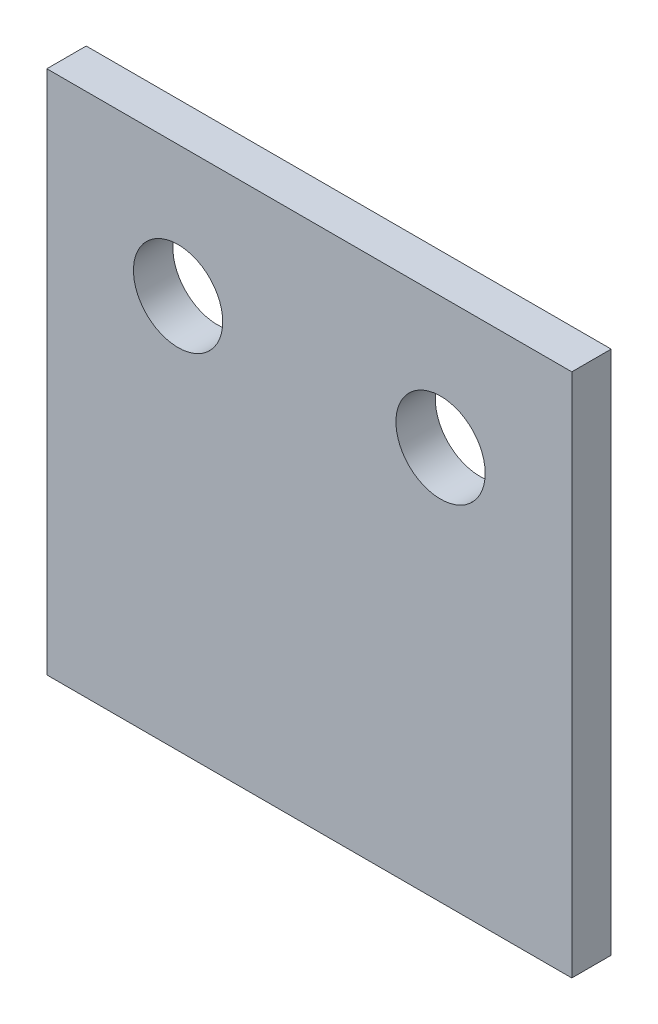
ISO-10303-21;
HEADER;
FILE_DESCRIPTION(('STEP AP214'),'2;1');
FILE_NAME('part.step','',(''),(''),'','','');
FILE_SCHEMA(('AUTOMOTIVE_DESIGN { 1 0 10303 214 1 1 1 1 }'));
ENDSEC;
DATA;
#1=APPLICATION_CONTEXT('core data for automotive mechanical design processes');
#2=APPLICATION_PROTOCOL_DEFINITION('international standard','automotive_design',2000,#1);
#3=PRODUCT_CONTEXT('',#1,'mechanical');
#4=PRODUCT('Part','Part','',(#3));
#5=PRODUCT_RELATED_PRODUCT_CATEGORY('part','',(#4));
#6=PRODUCT_DEFINITION_FORMATION('','',#4);
#7=PRODUCT_DEFINITION_CONTEXT('part definition',#1,'design');
#8=PRODUCT_DEFINITION('design','',#6,#7);
#9=PRODUCT_DEFINITION_SHAPE('','',#8);
#10=(LENGTH_UNIT() NAMED_UNIT(*) SI_UNIT(.MILLI.,.METRE.));
#11=(NAMED_UNIT(*) PLANE_ANGLE_UNIT() SI_UNIT($,.RADIAN.));
#12=(NAMED_UNIT(*) SI_UNIT($,.STERADIAN.) SOLID_ANGLE_UNIT());
#13=UNCERTAINTY_MEASURE_WITH_UNIT(LENGTH_MEASURE(1.E-05),#10,'distance_accuracy_value','');
#14=(GEOMETRIC_REPRESENTATION_CONTEXT(3) GLOBAL_UNCERTAINTY_ASSIGNED_CONTEXT((#13)) GLOBAL_UNIT_ASSIGNED_CONTEXT((#10,
#11,#12)) REPRESENTATION_CONTEXT('',''));
#15=CARTESIAN_POINT('',(0.,0.,0.));
#16=DIRECTION('',(0.,0.,1.));
#17=DIRECTION('',(1.,0.,0.));
#18=AXIS2_PLACEMENT_3D('',#15,#16,#17);
#19=CARTESIAN_POINT('',(0.,0.,1.5));
#20=DIRECTION('',(1.,0.,0.));
#21=DIRECTION('',(0.,0.,-1.));
#22=AXIS2_PLACEMENT_3D('',#19,#20,#21);
#23=PLANE('',#22);
#24=DIRECTION('',(0.,-1.,0.));
#25=VECTOR('',#24,1.);
#26=CARTESIAN_POINT('',(0.,0.,0.));
#27=LINE('',#26,#25);
#28=CARTESIAN_POINT('',(0.,20.,0.));
#29=VERTEX_POINT('',#28);
#30=CARTESIAN_POINT('',(0.,0.,0.));
#31=VERTEX_POINT('',#30);
#32=EDGE_CURVE('E96',#29,#31,#27,.T.);
#33=ORIENTED_EDGE('',*,*,#32,.T.);
#34=DIRECTION('',(0.,0.,-1.));
#35=VECTOR('',#34,1.);
#36=CARTESIAN_POINT('',(0.,0.,1.5));
#37=LINE('',#36,#35);
#38=CARTESIAN_POINT('',(0.,0.,1.5));
#39=VERTEX_POINT('',#38);
#40=EDGE_CURVE('E11',#39,#31,#37,.T.);
#41=ORIENTED_EDGE('',*,*,#40,.F.);
#42=DIRECTION('',(0.,-1.,0.));
#43=VECTOR('',#42,1.);
#44=CARTESIAN_POINT('',(0.,0.,1.5));
#45=LINE('',#44,#43);
#46=CARTESIAN_POINT('',(0.,20.,1.5));
#47=VERTEX_POINT('',#46);
#48=EDGE_CURVE('E84',#47,#39,#45,.T.);
#49=ORIENTED_EDGE('',*,*,#48,.F.);
#50=DIRECTION('',(0.,0.,-1.));
#51=VECTOR('',#50,1.);
#52=CARTESIAN_POINT('',(0.,20.,1.5));
#53=LINE('',#52,#51);
#54=EDGE_CURVE('E92',#47,#29,#53,.T.);
#55=ORIENTED_EDGE('',*,*,#54,.T.);
#56=EDGE_LOOP('',(#33,#41,#49,#55));
#57=FACE_BOUND('',#56,.T.);
#58=ADVANCED_FACE('F33',(#57),#23,.F.);
#59=CARTESIAN_POINT('',(0.,0.,1.5));
#60=DIRECTION('',(0.,1.,0.));
#61=DIRECTION('',(0.,0.,1.));
#62=AXIS2_PLACEMENT_3D('',#59,#60,#61);
#63=PLANE('',#62);
#64=DIRECTION('',(1.,0.,0.));
#65=VECTOR('',#64,1.);
#66=CARTESIAN_POINT('',(0.,0.,0.));
#67=LINE('',#66,#65);
#68=CARTESIAN_POINT('',(20.,0.,0.));
#69=VERTEX_POINT('',#68);
#70=EDGE_CURVE('E88',#31,#69,#67,.T.);
#71=ORIENTED_EDGE('',*,*,#70,.T.);
#72=DIRECTION('',(0.,0.,-1.));
#73=VECTOR('',#72,1.);
#74=CARTESIAN_POINT('',(20.,0.,1.5));
#75=LINE('',#74,#73);
#76=CARTESIAN_POINT('',(20.,0.,1.5));
#77=VERTEX_POINT('',#76);
#78=EDGE_CURVE('E41',#77,#69,#75,.T.);
#79=ORIENTED_EDGE('',*,*,#78,.F.);
#80=DIRECTION('',(1.,0.,0.));
#81=VECTOR('',#80,1.);
#82=CARTESIAN_POINT('',(0.,0.,1.5));
#83=LINE('',#82,#81);
#84=EDGE_CURVE('E79',#39,#77,#83,.T.);
#85=ORIENTED_EDGE('',*,*,#84,.F.);
#86=ORIENTED_EDGE('',*,*,#40,.T.);
#87=EDGE_LOOP('',(#71,#79,#85,#86));
#88=FACE_BOUND('',#87,.T.);
#89=ADVANCED_FACE('F87',(#88),#63,.F.);
#90=CARTESIAN_POINT('',(20.,0.,1.5));
#91=DIRECTION('',(-1.,0.,0.));
#92=DIRECTION('',(0.,0.,1.));
#93=AXIS2_PLACEMENT_3D('',#90,#91,#92);
#94=PLANE('',#93);
#95=DIRECTION('',(0.,1.,0.));
#96=VECTOR('',#95,1.);
#97=CARTESIAN_POINT('',(20.,0.,0.));
#98=LINE('',#97,#96);
#99=CARTESIAN_POINT('',(20.,20.,0.));
#100=VERTEX_POINT('',#99);
#101=EDGE_CURVE('E66',#69,#100,#98,.T.);
#102=ORIENTED_EDGE('',*,*,#101,.T.);
#103=DIRECTION('',(0.,0.,-1.));
#104=VECTOR('',#103,1.);
#105=CARTESIAN_POINT('',(20.,20.,1.5));
#106=LINE('',#105,#104);
#107=CARTESIAN_POINT('',(20.,20.,1.5));
#108=VERTEX_POINT('',#107);
#109=EDGE_CURVE('E89',#108,#100,#106,.T.);
#110=ORIENTED_EDGE('',*,*,#109,.F.);
#111=DIRECTION('',(0.,1.,0.));
#112=VECTOR('',#111,1.);
#113=CARTESIAN_POINT('',(20.,0.,1.5));
#114=LINE('',#113,#112);
#115=EDGE_CURVE('E82',#77,#108,#114,.T.);
#116=ORIENTED_EDGE('',*,*,#115,.F.);
#117=ORIENTED_EDGE('',*,*,#78,.T.);
#118=EDGE_LOOP('',(#102,#110,#116,#117));
#119=FACE_BOUND('',#118,.T.);
#120=ADVANCED_FACE('F90',(#119),#94,.F.);
#121=CARTESIAN_POINT('',(0.,20.,1.5));
#122=DIRECTION('',(0.,-1.,0.));
#123=DIRECTION('',(0.,0.,-1.));
#124=AXIS2_PLACEMENT_3D('',#121,#122,#123);
#125=PLANE('',#124);
#126=DIRECTION('',(-1.,0.,0.));
#127=VECTOR('',#126,1.);
#128=CARTESIAN_POINT('',(0.,20.,0.));
#129=LINE('',#128,#127);
#130=EDGE_CURVE('E72',#100,#29,#129,.T.);
#131=ORIENTED_EDGE('',*,*,#130,.T.);
#132=ORIENTED_EDGE('',*,*,#54,.F.);
#133=DIRECTION('',(-1.,0.,0.));
#134=VECTOR('',#133,1.);
#135=CARTESIAN_POINT('',(0.,20.,1.5));
#136=LINE('',#135,#134);
#137=EDGE_CURVE('E49',#108,#47,#136,.T.);
#138=ORIENTED_EDGE('',*,*,#137,.F.);
#139=ORIENTED_EDGE('',*,*,#109,.T.);
#140=EDGE_LOOP('',(#131,#132,#138,#139));
#141=FACE_BOUND('',#140,.T.);
#142=ADVANCED_FACE('F104',(#141),#125,.F.);
#143=CARTESIAN_POINT('',(0.,0.,1.5));
#144=DIRECTION('',(0.,0.,-1.));
#145=DIRECTION('',(-1.,0.,0.));
#146=AXIS2_PLACEMENT_3D('',#143,#144,#145);
#147=PLANE('',#146);
#148=CARTESIAN_POINT('',(5.,15.,1.5));
#149=DIRECTION('',(0.,0.,1.));
#150=DIRECTION('',(1.,0.,0.));
#151=AXIS2_PLACEMENT_3D('',#148,#149,#150);
#152=CIRCLE('',#151,1.69999999999999);
#153=CARTESIAN_POINT('',(6.69999999999999,15.,1.5));
#154=VERTEX_POINT('',#153);
#155=EDGE_CURVE('E118',#154,#154,#152,.T.);
#156=ORIENTED_EDGE('',*,*,#155,.F.);
#157=EDGE_LOOP('',(#156));
#158=FACE_BOUND('',#157,.T.);
#159=CARTESIAN_POINT('',(15.,15.,1.5));
#160=DIRECTION('',(0.,0.,1.));
#161=DIRECTION('',(1.,0.,0.));
#162=AXIS2_PLACEMENT_3D('',#159,#160,#161);
#163=CIRCLE('',#162,1.69999999999999);
#164=CARTESIAN_POINT('',(16.7,15.,1.5));
#165=VERTEX_POINT('',#164);
#166=EDGE_CURVE('E112',#165,#165,#163,.T.);
#167=ORIENTED_EDGE('',*,*,#166,.F.);
#168=EDGE_LOOP('',(#167));
#169=FACE_BOUND('',#168,.T.);
#170=ORIENTED_EDGE('',*,*,#48,.T.);
#171=ORIENTED_EDGE('',*,*,#84,.T.);
#172=ORIENTED_EDGE('',*,*,#115,.T.);
#173=ORIENTED_EDGE('',*,*,#137,.T.);
#174=EDGE_LOOP('',(#170,#171,#172,#173));
#175=FACE_BOUND('',#174,.T.);
#176=ADVANCED_FACE('F80',(#158,#169,#175),#147,.F.);
#177=CARTESIAN_POINT('',(0.,0.,0.));
#178=DIRECTION('',(0.,0.,-1.));
#179=DIRECTION('',(-1.,0.,0.));
#180=AXIS2_PLACEMENT_3D('',#177,#178,#179);
#181=PLANE('',#180);
#182=CARTESIAN_POINT('',(5.,15.,0.));
#183=DIRECTION('',(0.,0.,1.));
#184=DIRECTION('',(1.,0.,0.));
#185=AXIS2_PLACEMENT_3D('',#182,#183,#184);
#186=CIRCLE('',#185,1.7);
#187=CARTESIAN_POINT('',(6.7,15.,0.));
#188=VERTEX_POINT('',#187);
#189=EDGE_CURVE('E115',#188,#188,#186,.T.);
#190=ORIENTED_EDGE('',*,*,#189,.T.);
#191=EDGE_LOOP('',(#190));
#192=FACE_BOUND('',#191,.T.);
#193=CARTESIAN_POINT('',(15.,15.,0.));
#194=DIRECTION('',(0.,0.,1.));
#195=DIRECTION('',(1.,0.,0.));
#196=AXIS2_PLACEMENT_3D('',#193,#194,#195);
#197=CIRCLE('',#196,1.7);
#198=CARTESIAN_POINT('',(16.7,15.,0.));
#199=VERTEX_POINT('',#198);
#200=EDGE_CURVE('E99',#199,#199,#197,.T.);
#201=ORIENTED_EDGE('',*,*,#200,.T.);
#202=EDGE_LOOP('',(#201));
#203=FACE_BOUND('',#202,.T.);
#204=ORIENTED_EDGE('',*,*,#32,.F.);
#205=ORIENTED_EDGE('',*,*,#130,.F.);
#206=ORIENTED_EDGE('',*,*,#101,.F.);
#207=ORIENTED_EDGE('',*,*,#70,.F.);
#208=EDGE_LOOP('',(#204,#205,#206,#207));
#209=FACE_BOUND('',#208,.T.);
#210=ADVANCED_FACE('F107',(#192,#203,#209),#181,.T.);
#211=CARTESIAN_POINT('',(15.,15.,1.5));
#212=DIRECTION('',(0.,0.,1.));
#213=DIRECTION('',(1.,0.,0.));
#214=AXIS2_PLACEMENT_3D('',#211,#212,#213);
#215=CYLINDRICAL_SURFACE('',#214,1.69999999999999);
#216=ORIENTED_EDGE('',*,*,#200,.F.);
#217=EDGE_LOOP('',(#216));
#218=FACE_BOUND('',#217,.T.);
#219=ORIENTED_EDGE('',*,*,#166,.T.);
#220=EDGE_LOOP('',(#219));
#221=FACE_BOUND('',#220,.T.);
#222=ADVANCED_FACE('F129',(#218,#221),#215,.F.);
#223=CARTESIAN_POINT('',(5.,15.,1.5));
#224=DIRECTION('',(0.,0.,1.));
#225=DIRECTION('',(1.,0.,0.));
#226=AXIS2_PLACEMENT_3D('',#223,#224,#225);
#227=CYLINDRICAL_SURFACE('',#226,1.69999999999999);
#228=ORIENTED_EDGE('',*,*,#189,.F.);
#229=EDGE_LOOP('',(#228));
#230=FACE_BOUND('',#229,.T.);
#231=ORIENTED_EDGE('',*,*,#155,.T.);
#232=EDGE_LOOP('',(#231));
#233=FACE_BOUND('',#232,.T.);
#234=ADVANCED_FACE('F122',(#230,#233),#227,.F.);
#235=CLOSED_SHELL('',(#58,#89,#120,#142,#176,#210,#222,#234));
#236=MANIFOLD_SOLID_BREP('B2',#235);
#237=ADVANCED_BREP_SHAPE_REPRESENTATION('',(#18,#236),#14);
#238=SHAPE_DEFINITION_REPRESENTATION(#9,#237);
ENDSEC;
END-ISO-10303-21;
